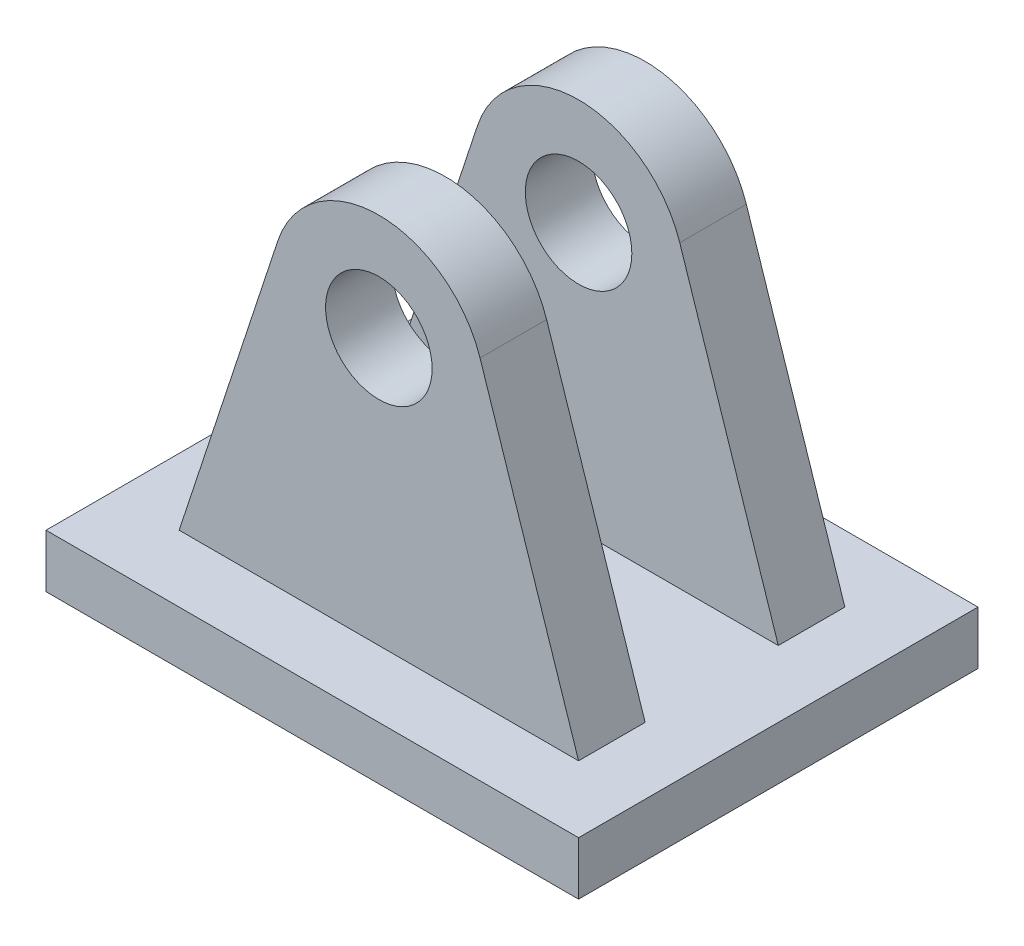
ISO-10303-21;
HEADER;
FILE_DESCRIPTION(('STEP AP214'),'2;1');
FILE_NAME('part.step','',(''),(''),'','','');
FILE_SCHEMA(('AUTOMOTIVE_DESIGN { 1 0 10303 214 1 1 1 1 }'));
ENDSEC;
DATA;
#1=APPLICATION_CONTEXT('core data for automotive mechanical design processes');
#2=APPLICATION_PROTOCOL_DEFINITION('international standard','automotive_design',2000,#1);
#3=PRODUCT_CONTEXT('',#1,'mechanical');
#4=PRODUCT('Part','Part','',(#3));
#5=PRODUCT_RELATED_PRODUCT_CATEGORY('part','',(#4));
#6=PRODUCT_DEFINITION_FORMATION('','',#4);
#7=PRODUCT_DEFINITION_CONTEXT('part definition',#1,'design');
#8=PRODUCT_DEFINITION('design','',#6,#7);
#9=PRODUCT_DEFINITION_SHAPE('','',#8);
#10=(LENGTH_UNIT() NAMED_UNIT(*) SI_UNIT(.MILLI.,.METRE.));
#11=(NAMED_UNIT(*) PLANE_ANGLE_UNIT() SI_UNIT($,.RADIAN.));
#12=(NAMED_UNIT(*) SI_UNIT($,.STERADIAN.) SOLID_ANGLE_UNIT());
#13=UNCERTAINTY_MEASURE_WITH_UNIT(LENGTH_MEASURE(1.E-05),#10,'distance_accuracy_value','');
#14=(GEOMETRIC_REPRESENTATION_CONTEXT(3) GLOBAL_UNCERTAINTY_ASSIGNED_CONTEXT((#13)) GLOBAL_UNIT_ASSIGNED_CONTEXT((#10,
#11,#12)) REPRESENTATION_CONTEXT('',''));
#15=CARTESIAN_POINT('',(0.,0.,0.));
#16=DIRECTION('',(0.,0.,1.));
#17=DIRECTION('',(1.,0.,0.));
#18=AXIS2_PLACEMENT_3D('',#15,#16,#17);
#19=CARTESIAN_POINT('',(0.,120.,50.));
#20=DIRECTION('',(0.,0.,-1.));
#21=DIRECTION('',(-1.,0.,0.));
#22=AXIS2_PLACEMENT_3D('',#19,#20,#21);
#23=CYLINDRICAL_SURFACE('',#22,40.);
#24=CARTESIAN_POINT('',(0.,120.,-25.));
#25=DIRECTION('',(0.,0.,1.));
#26=DIRECTION('',(1.,0.,0.));
#27=AXIS2_PLACEMENT_3D('',#24,#25,#26);
#28=CIRCLE('',#27,40.);
#29=CARTESIAN_POINT('',(37.9973613627572,132.498021022068,-25.));
#30=VERTEX_POINT('',#29);
#31=CARTESIAN_POINT('',(-37.9973613627572,132.498021022068,-25.));
#32=VERTEX_POINT('',#31);
#33=EDGE_CURVE('E131',#30,#32,#28,.T.);
#34=ORIENTED_EDGE('',*,*,#33,.F.);
#35=DIRECTION('',(0.,0.,-1.));
#36=VECTOR('',#35,1.);
#37=CARTESIAN_POINT('',(37.9973613627572,132.498021022068,50.));
#38=LINE('',#37,#36);
#39=CARTESIAN_POINT('',(37.9973613627572,132.498021022068,-50.));
#40=VERTEX_POINT('',#39);
#41=EDGE_CURVE('E241',#30,#40,#38,.T.);
#42=ORIENTED_EDGE('',*,*,#41,.T.);
#43=CARTESIAN_POINT('',(0.,120.,-50.));
#44=DIRECTION('',(0.,0.,1.));
#45=DIRECTION('',(1.,0.,0.));
#46=AXIS2_PLACEMENT_3D('',#43,#44,#45);
#47=CIRCLE('',#46,40.);
#48=CARTESIAN_POINT('',(-37.9973613627572,132.498021022068,-50.));
#49=VERTEX_POINT('',#48);
#50=EDGE_CURVE('E151',#40,#49,#47,.T.);
#51=ORIENTED_EDGE('',*,*,#50,.T.);
#52=DIRECTION('',(0.,0.,-1.));
#53=VECTOR('',#52,1.);
#54=CARTESIAN_POINT('',(-37.9973613627572,132.498021022068,50.));
#55=LINE('',#54,#53);
#56=EDGE_CURVE('E145',#32,#49,#55,.T.);
#57=ORIENTED_EDGE('',*,*,#56,.F.);
#58=EDGE_LOOP('',(#34,#42,#51,#57));
#59=FACE_BOUND('',#58,.T.);
#60=ADVANCED_FACE('F39',(#59),#23,.T.);
#61=CARTESIAN_POINT('',(-37.9973613627572,132.498021022068,50.));
#62=DIRECTION('',(0.949934034068929,-0.312450525551696,0.));
#63=DIRECTION('',(0.312450525551696,0.949934034068929,0.));
#64=AXIS2_PLACEMENT_3D('',#61,#62,#63);
#65=PLANE('',#64);
#66=DIRECTION('',(-0.312450525551696,-0.949934034068929,0.));
#67=VECTOR('',#66,1.);
#68=CARTESIAN_POINT('',(-37.9973613627572,132.498021022068,-25.));
#69=LINE('',#68,#67);
#70=CARTESIAN_POINT('',(-75.,20.,-25.));
#71=VERTEX_POINT('',#70);
#72=EDGE_CURVE('E134',#32,#71,#69,.T.);
#73=ORIENTED_EDGE('',*,*,#72,.F.);
#74=ORIENTED_EDGE('',*,*,#56,.T.);
#75=DIRECTION('',(-0.312450525551696,-0.949934034068929,0.));
#76=VECTOR('',#75,1.);
#77=CARTESIAN_POINT('',(-37.9973613627572,132.498021022068,-50.));
#78=LINE('',#77,#76);
#79=CARTESIAN_POINT('',(-75.,20.,-50.));
#80=VERTEX_POINT('',#79);
#81=EDGE_CURVE('E268',#49,#80,#78,.T.);
#82=ORIENTED_EDGE('',*,*,#81,.T.);
#83=DIRECTION('',(0.,0.,-1.));
#84=VECTOR('',#83,1.);
#85=CARTESIAN_POINT('',(-75.,20.,50.));
#86=LINE('',#85,#84);
#87=EDGE_CURVE('E63',#71,#80,#86,.T.);
#88=ORIENTED_EDGE('',*,*,#87,.F.);
#89=EDGE_LOOP('',(#73,#74,#82,#88));
#90=FACE_BOUND('',#89,.T.);
#91=ADVANCED_FACE('F143',(#90),#65,.F.);
#92=CARTESIAN_POINT('',(37.9973613627572,132.498021022068,50.));
#93=DIRECTION('',(-0.949934034068929,-0.312450525551696,0.));
#94=DIRECTION('',(0.312450525551696,-0.949934034068929,0.));
#95=AXIS2_PLACEMENT_3D('',#92,#93,#94);
#96=PLANE('',#95);
#97=DIRECTION('',(-0.312450525551696,0.949934034068929,0.));
#98=VECTOR('',#97,1.);
#99=CARTESIAN_POINT('',(75.,20.,-25.));
#100=LINE('',#99,#98);
#101=CARTESIAN_POINT('',(75.,20.,-25.));
#102=VERTEX_POINT('',#101);
#103=EDGE_CURVE('E136',#102,#30,#100,.T.);
#104=ORIENTED_EDGE('',*,*,#103,.F.);
#105=DIRECTION('',(0.,0.,-1.));
#106=VECTOR('',#105,1.);
#107=CARTESIAN_POINT('',(75.,20.,50.));
#108=LINE('',#107,#106);
#109=CARTESIAN_POINT('',(75.,20.,-50.));
#110=VERTEX_POINT('',#109);
#111=EDGE_CURVE('E240',#102,#110,#108,.T.);
#112=ORIENTED_EDGE('',*,*,#111,.T.);
#113=DIRECTION('',(-0.312450525551696,0.949934034068929,0.));
#114=VECTOR('',#113,1.);
#115=CARTESIAN_POINT('',(37.9973613627572,132.498021022068,-50.));
#116=LINE('',#115,#114);
#117=EDGE_CURVE('E246',#110,#40,#116,.T.);
#118=ORIENTED_EDGE('',*,*,#117,.T.);
#119=ORIENTED_EDGE('',*,*,#41,.F.);
#120=EDGE_LOOP('',(#104,#112,#118,#119));
#121=FACE_BOUND('',#120,.T.);
#122=ADVANCED_FACE('F212',(#121),#96,.F.);
#123=CARTESIAN_POINT('',(100.,20.,75.));
#124=DIRECTION('',(-1.,0.,0.));
#125=DIRECTION('',(0.,0.,1.));
#126=AXIS2_PLACEMENT_3D('',#123,#124,#125);
#127=PLANE('',#126);
#128=DIRECTION('',(0.,0.,-1.));
#129=VECTOR('',#128,1.);
#130=CARTESIAN_POINT('',(100.,0.,75.));
#131=LINE('',#130,#129);
#132=CARTESIAN_POINT('',(100.,0.,75.));
#133=VERTEX_POINT('',#132);
#134=CARTESIAN_POINT('',(100.,0.,-75.));
#135=VERTEX_POINT('',#134);
#136=EDGE_CURVE('E156',#133,#135,#131,.T.);
#137=ORIENTED_EDGE('',*,*,#136,.T.);
#138=DIRECTION('',(0.,-1.,0.));
#139=VECTOR('',#138,1.);
#140=CARTESIAN_POINT('',(100.,20.,-75.));
#141=LINE('',#140,#139);
#142=CARTESIAN_POINT('',(100.,20.,-75.));
#143=VERTEX_POINT('',#142);
#144=EDGE_CURVE('E11',#143,#135,#141,.T.);
#145=ORIENTED_EDGE('',*,*,#144,.F.);
#146=DIRECTION('',(0.,0.,-1.));
#147=VECTOR('',#146,1.);
#148=CARTESIAN_POINT('',(100.,20.,75.));
#149=LINE('',#148,#147);
#150=CARTESIAN_POINT('',(100.,20.,75.));
#151=VERTEX_POINT('',#150);
#152=EDGE_CURVE('E161',#151,#143,#149,.T.);
#153=ORIENTED_EDGE('',*,*,#152,.F.);
#154=DIRECTION('',(0.,-1.,0.));
#155=VECTOR('',#154,1.);
#156=CARTESIAN_POINT('',(100.,20.,75.));
#157=LINE('',#156,#155);
#158=EDGE_CURVE('E171',#151,#133,#157,.T.);
#159=ORIENTED_EDGE('',*,*,#158,.T.);
#160=EDGE_LOOP('',(#137,#145,#153,#159));
#161=FACE_BOUND('',#160,.T.);
#162=ADVANCED_FACE('F41',(#161),#127,.F.);
#163=CARTESIAN_POINT('',(-100.,20.,-75.));
#164=DIRECTION('',(0.,0.,1.));
#165=DIRECTION('',(1.,0.,0.));
#166=AXIS2_PLACEMENT_3D('',#163,#164,#165);
#167=PLANE('',#166);
#168=DIRECTION('',(-1.,0.,0.));
#169=VECTOR('',#168,1.);
#170=CARTESIAN_POINT('',(-100.,0.,-75.));
#171=LINE('',#170,#169);
#172=CARTESIAN_POINT('',(-100.,0.,-75.));
#173=VERTEX_POINT('',#172);
#174=EDGE_CURVE('E174',#135,#173,#171,.T.);
#175=ORIENTED_EDGE('',*,*,#174,.T.);
#176=DIRECTION('',(0.,-1.,0.));
#177=VECTOR('',#176,1.);
#178=CARTESIAN_POINT('',(-100.,20.,-75.));
#179=LINE('',#178,#177);
#180=CARTESIAN_POINT('',(-100.,20.,-75.));
#181=VERTEX_POINT('',#180);
#182=EDGE_CURVE('E48',#181,#173,#179,.T.);
#183=ORIENTED_EDGE('',*,*,#182,.F.);
#184=DIRECTION('',(-1.,0.,0.));
#185=VECTOR('',#184,1.);
#186=CARTESIAN_POINT('',(-100.,20.,-75.));
#187=LINE('',#186,#185);
#188=EDGE_CURVE('E164',#143,#181,#187,.T.);
#189=ORIENTED_EDGE('',*,*,#188,.F.);
#190=ORIENTED_EDGE('',*,*,#144,.T.);
#191=EDGE_LOOP('',(#175,#183,#189,#190));
#192=FACE_BOUND('',#191,.T.);
#193=ADVANCED_FACE('F205',(#192),#167,.F.);
#194=CARTESIAN_POINT('',(-100.,20.,75.));
#195=DIRECTION('',(1.,0.,0.));
#196=DIRECTION('',(0.,0.,-1.));
#197=AXIS2_PLACEMENT_3D('',#194,#195,#196);
#198=PLANE('',#197);
#199=DIRECTION('',(0.,0.,1.));
#200=VECTOR('',#199,1.);
#201=CARTESIAN_POINT('',(-100.,0.,75.));
#202=LINE('',#201,#200);
#203=CARTESIAN_POINT('',(-100.,0.,75.));
#204=VERTEX_POINT('',#203);
#205=EDGE_CURVE('E176',#173,#204,#202,.T.);
#206=ORIENTED_EDGE('',*,*,#205,.T.);
#207=DIRECTION('',(0.,-1.,0.));
#208=VECTOR('',#207,1.);
#209=CARTESIAN_POINT('',(-100.,20.,75.));
#210=LINE('',#209,#208);
#211=CARTESIAN_POINT('',(-100.,20.,75.));
#212=VERTEX_POINT('',#211);
#213=EDGE_CURVE('E181',#212,#204,#210,.T.);
#214=ORIENTED_EDGE('',*,*,#213,.F.);
#215=DIRECTION('',(0.,0.,1.));
#216=VECTOR('',#215,1.);
#217=CARTESIAN_POINT('',(-100.,20.,75.));
#218=LINE('',#217,#216);
#219=EDGE_CURVE('E167',#181,#212,#218,.T.);
#220=ORIENTED_EDGE('',*,*,#219,.F.);
#221=ORIENTED_EDGE('',*,*,#182,.T.);
#222=EDGE_LOOP('',(#206,#214,#220,#221));
#223=FACE_BOUND('',#222,.T.);
#224=ADVANCED_FACE('F189',(#223),#198,.F.);
#225=CARTESIAN_POINT('',(-100.,20.,75.));
#226=DIRECTION('',(0.,0.,-1.));
#227=DIRECTION('',(-1.,0.,0.));
#228=AXIS2_PLACEMENT_3D('',#225,#226,#227);
#229=PLANE('',#228);
#230=DIRECTION('',(1.,0.,0.));
#231=VECTOR('',#230,1.);
#232=CARTESIAN_POINT('',(-100.,0.,75.));
#233=LINE('',#232,#231);
#234=EDGE_CURVE('E165',#204,#133,#233,.T.);
#235=ORIENTED_EDGE('',*,*,#234,.T.);
#236=ORIENTED_EDGE('',*,*,#158,.F.);
#237=DIRECTION('',(1.,0.,0.));
#238=VECTOR('',#237,1.);
#239=CARTESIAN_POINT('',(-100.,20.,75.));
#240=LINE('',#239,#238);
#241=EDGE_CURVE('E169',#212,#151,#240,.T.);
#242=ORIENTED_EDGE('',*,*,#241,.F.);
#243=ORIENTED_EDGE('',*,*,#213,.T.);
#244=EDGE_LOOP('',(#235,#236,#242,#243));
#245=FACE_BOUND('',#244,.T.);
#246=ADVANCED_FACE('F198',(#245),#229,.F.);
#247=CARTESIAN_POINT('',(0.,20.,0.));
#248=DIRECTION('',(0.,-1.,0.));
#249=DIRECTION('',(0.,0.,-1.));
#250=AXIS2_PLACEMENT_3D('',#247,#248,#249);
#251=PLANE('',#250);
#252=CARTESIAN_POINT('',(-75.,20.,50.));
#253=VERTEX_POINT('',#252);
#254=CARTESIAN_POINT('',(-75.,20.,25.));
#255=VERTEX_POINT('',#254);
#256=EDGE_CURVE('E153',#253,#255,#86,.T.);
#257=ORIENTED_EDGE('',*,*,#256,.T.);
#258=DIRECTION('',(1.,0.,0.));
#259=VECTOR('',#258,1.);
#260=CARTESIAN_POINT('',(-75.,20.,25.));
#261=LINE('',#260,#259);
#262=CARTESIAN_POINT('',(75.,20.,25.));
#263=VERTEX_POINT('',#262);
#264=EDGE_CURVE('E253',#255,#263,#261,.T.);
#265=ORIENTED_EDGE('',*,*,#264,.T.);
#266=CARTESIAN_POINT('',(75.,20.,50.));
#267=VERTEX_POINT('',#266);
#268=EDGE_CURVE('E243',#267,#263,#108,.T.);
#269=ORIENTED_EDGE('',*,*,#268,.F.);
#270=DIRECTION('',(1.,0.,0.));
#271=VECTOR('',#270,1.);
#272=CARTESIAN_POINT('',(-75.,20.,50.));
#273=LINE('',#272,#271);
#274=EDGE_CURVE('E252',#253,#267,#273,.T.);
#275=ORIENTED_EDGE('',*,*,#274,.F.);
#276=EDGE_LOOP('',(#257,#265,#269,#275));
#277=FACE_BOUND('',#276,.T.);
#278=DIRECTION('',(1.,0.,0.));
#279=VECTOR('',#278,1.);
#280=CARTESIAN_POINT('',(-75.,20.,-25.));
#281=LINE('',#280,#279);
#282=EDGE_CURVE('E147',#71,#102,#281,.T.);
#283=ORIENTED_EDGE('',*,*,#282,.F.);
#284=ORIENTED_EDGE('',*,*,#87,.T.);
#285=DIRECTION('',(1.,0.,0.));
#286=VECTOR('',#285,1.);
#287=CARTESIAN_POINT('',(-75.,20.,-50.));
#288=LINE('',#287,#286);
#289=EDGE_CURVE('E269',#80,#110,#288,.T.);
#290=ORIENTED_EDGE('',*,*,#289,.T.);
#291=ORIENTED_EDGE('',*,*,#111,.F.);
#292=EDGE_LOOP('',(#283,#284,#290,#291));
#293=FACE_BOUND('',#292,.T.);
#294=ORIENTED_EDGE('',*,*,#152,.T.);
#295=ORIENTED_EDGE('',*,*,#188,.T.);
#296=ORIENTED_EDGE('',*,*,#219,.T.);
#297=ORIENTED_EDGE('',*,*,#241,.T.);
#298=EDGE_LOOP('',(#294,#295,#296,#297));
#299=FACE_BOUND('',#298,.T.);
#300=ADVANCED_FACE('F204',(#277,#293,#299),#251,.F.);
#301=CARTESIAN_POINT('',(0.,0.,0.));
#302=DIRECTION('',(0.,-1.,0.));
#303=DIRECTION('',(0.,0.,-1.));
#304=AXIS2_PLACEMENT_3D('',#301,#302,#303);
#305=PLANE('',#304);
#306=ORIENTED_EDGE('',*,*,#136,.F.);
#307=ORIENTED_EDGE('',*,*,#234,.F.);
#308=ORIENTED_EDGE('',*,*,#205,.F.);
#309=ORIENTED_EDGE('',*,*,#174,.F.);
#310=EDGE_LOOP('',(#306,#307,#308,#309));
#311=FACE_BOUND('',#310,.T.);
#312=ADVANCED_FACE('F195',(#311),#305,.T.);
#313=CARTESIAN_POINT('',(37.9973613627572,132.498021022068,50.));
#314=VERTEX_POINT('',#313);
#315=CARTESIAN_POINT('',(37.9973613627572,132.498021022068,25.));
#316=VERTEX_POINT('',#315);
#317=EDGE_CURVE('E234',#314,#316,#38,.T.);
#318=ORIENTED_EDGE('',*,*,#317,.T.);
#319=CARTESIAN_POINT('',(0.,120.,25.));
#320=DIRECTION('',(0.,0.,1.));
#321=DIRECTION('',(1.,0.,0.));
#322=AXIS2_PLACEMENT_3D('',#319,#320,#321);
#323=CIRCLE('',#322,40.);
#324=CARTESIAN_POINT('',(-37.9973613627572,132.498021022068,25.));
#325=VERTEX_POINT('',#324);
#326=EDGE_CURVE('E55',#316,#325,#323,.T.);
#327=ORIENTED_EDGE('',*,*,#326,.T.);
#328=CARTESIAN_POINT('',(-37.9973613627572,132.498021022068,50.));
#329=VERTEX_POINT('',#328);
#330=EDGE_CURVE('E152',#329,#325,#55,.T.);
#331=ORIENTED_EDGE('',*,*,#330,.F.);
#332=CARTESIAN_POINT('',(0.,120.,50.));
#333=DIRECTION('',(0.,0.,1.));
#334=DIRECTION('',(1.,0.,0.));
#335=AXIS2_PLACEMENT_3D('',#332,#333,#334);
#336=CIRCLE('',#335,40.);
#337=EDGE_CURVE('E237',#314,#329,#336,.T.);
#338=ORIENTED_EDGE('',*,*,#337,.F.);
#339=EDGE_LOOP('',(#318,#327,#331,#338));
#340=FACE_BOUND('',#339,.T.);
#341=ADVANCED_FACE('F215',(#340),#23,.T.);
#342=ORIENTED_EDGE('',*,*,#330,.T.);
#343=DIRECTION('',(-0.312450525551696,-0.949934034068929,0.));
#344=VECTOR('',#343,1.);
#345=CARTESIAN_POINT('',(-37.9973613627572,132.498021022068,25.));
#346=LINE('',#345,#344);
#347=EDGE_CURVE('E256',#325,#255,#346,.T.);
#348=ORIENTED_EDGE('',*,*,#347,.T.);
#349=ORIENTED_EDGE('',*,*,#256,.F.);
#350=DIRECTION('',(-0.312450525551696,-0.949934034068929,0.));
#351=VECTOR('',#350,1.);
#352=CARTESIAN_POINT('',(-37.9973613627572,132.498021022068,50.));
#353=LINE('',#352,#351);
#354=EDGE_CURVE('E263',#329,#253,#353,.T.);
#355=ORIENTED_EDGE('',*,*,#354,.F.);
#356=EDGE_LOOP('',(#342,#348,#349,#355));
#357=FACE_BOUND('',#356,.T.);
#358=ADVANCED_FACE('F220',(#357),#65,.F.);
#359=ORIENTED_EDGE('',*,*,#268,.T.);
#360=DIRECTION('',(-0.312450525551696,0.949934034068929,0.));
#361=VECTOR('',#360,1.);
#362=CARTESIAN_POINT('',(75.,20.,25.));
#363=LINE('',#362,#361);
#364=EDGE_CURVE('E140',#263,#316,#363,.T.);
#365=ORIENTED_EDGE('',*,*,#364,.T.);
#366=ORIENTED_EDGE('',*,*,#317,.F.);
#367=DIRECTION('',(-0.312450525551696,0.949934034068929,0.));
#368=VECTOR('',#367,1.);
#369=CARTESIAN_POINT('',(37.9973613627572,132.498021022068,50.));
#370=LINE('',#369,#368);
#371=EDGE_CURVE('E244',#267,#314,#370,.T.);
#372=ORIENTED_EDGE('',*,*,#371,.F.);
#373=EDGE_LOOP('',(#359,#365,#366,#372));
#374=FACE_BOUND('',#373,.T.);
#375=ADVANCED_FACE('F228',(#374),#96,.F.);
#376=CARTESIAN_POINT('',(0.,120.,50.));
#377=DIRECTION('',(0.,0.,1.));
#378=DIRECTION('',(1.,0.,0.));
#379=AXIS2_PLACEMENT_3D('',#376,#377,#378);
#380=PLANE('',#379);
#381=CARTESIAN_POINT('',(0.,120.,50.));
#382=DIRECTION('',(0.,0.,1.));
#383=DIRECTION('',(1.,0.,0.));
#384=AXIS2_PLACEMENT_3D('',#381,#382,#383);
#385=CIRCLE('',#384,20.);
#386=CARTESIAN_POINT('',(20.,120.,50.));
#387=VERTEX_POINT('',#386);
#388=EDGE_CURVE('E448',#387,#387,#385,.T.);
#389=ORIENTED_EDGE('',*,*,#388,.F.);
#390=EDGE_LOOP('',(#389));
#391=FACE_BOUND('',#390,.T.);
#392=ORIENTED_EDGE('',*,*,#337,.T.);
#393=ORIENTED_EDGE('',*,*,#354,.T.);
#394=ORIENTED_EDGE('',*,*,#274,.T.);
#395=ORIENTED_EDGE('',*,*,#371,.T.);
#396=EDGE_LOOP('',(#392,#393,#394,#395));
#397=FACE_BOUND('',#396,.T.);
#398=ADVANCED_FACE('F277',(#391,#397),#380,.T.);
#399=CARTESIAN_POINT('',(0.,120.,-50.));
#400=DIRECTION('',(0.,0.,1.));
#401=DIRECTION('',(1.,0.,0.));
#402=AXIS2_PLACEMENT_3D('',#399,#400,#401);
#403=PLANE('',#402);
#404=CARTESIAN_POINT('',(0.,120.,-50.));
#405=DIRECTION('',(0.,0.,1.));
#406=DIRECTION('',(1.,0.,0.));
#407=AXIS2_PLACEMENT_3D('',#404,#405,#406);
#408=CIRCLE('',#407,20.);
#409=CARTESIAN_POINT('',(20.,120.,-50.));
#410=VERTEX_POINT('',#409);
#411=EDGE_CURVE('E440',#410,#410,#408,.T.);
#412=ORIENTED_EDGE('',*,*,#411,.T.);
#413=EDGE_LOOP('',(#412));
#414=FACE_BOUND('',#413,.T.);
#415=ORIENTED_EDGE('',*,*,#50,.F.);
#416=ORIENTED_EDGE('',*,*,#117,.F.);
#417=ORIENTED_EDGE('',*,*,#289,.F.);
#418=ORIENTED_EDGE('',*,*,#81,.F.);
#419=EDGE_LOOP('',(#415,#416,#417,#418));
#420=FACE_BOUND('',#419,.T.);
#421=ADVANCED_FACE('F275',(#414,#420),#403,.F.);
#422=CARTESIAN_POINT('',(0.,120.,-25.));
#423=DIRECTION('',(0.,0.,1.));
#424=DIRECTION('',(1.,0.,0.));
#425=AXIS2_PLACEMENT_3D('',#422,#423,#424);
#426=PLANE('',#425);
#427=CARTESIAN_POINT('',(0.,120.,-25.));
#428=DIRECTION('',(0.,0.,1.));
#429=DIRECTION('',(1.,0.,0.));
#430=AXIS2_PLACEMENT_3D('',#427,#428,#429);
#431=CIRCLE('',#430,20.);
#432=CARTESIAN_POINT('',(20.,120.,-25.));
#433=VERTEX_POINT('',#432);
#434=EDGE_CURVE('E438',#433,#433,#431,.T.);
#435=ORIENTED_EDGE('',*,*,#434,.F.);
#436=EDGE_LOOP('',(#435));
#437=FACE_BOUND('',#436,.T.);
#438=ORIENTED_EDGE('',*,*,#33,.T.);
#439=ORIENTED_EDGE('',*,*,#72,.T.);
#440=ORIENTED_EDGE('',*,*,#282,.T.);
#441=ORIENTED_EDGE('',*,*,#103,.T.);
#442=EDGE_LOOP('',(#438,#439,#440,#441));
#443=FACE_BOUND('',#442,.T.);
#444=ADVANCED_FACE('F133',(#437,#443),#426,.T.);
#445=CARTESIAN_POINT('',(0.,120.,25.));
#446=DIRECTION('',(0.,0.,1.));
#447=DIRECTION('',(1.,0.,0.));
#448=AXIS2_PLACEMENT_3D('',#445,#446,#447);
#449=PLANE('',#448);
#450=CARTESIAN_POINT('',(0.,120.,25.));
#451=DIRECTION('',(0.,0.,1.));
#452=DIRECTION('',(1.,0.,0.));
#453=AXIS2_PLACEMENT_3D('',#450,#451,#452);
#454=CIRCLE('',#453,20.);
#455=CARTESIAN_POINT('',(20.,120.,25.));
#456=VERTEX_POINT('',#455);
#457=EDGE_CURVE('E43',#456,#456,#454,.T.);
#458=ORIENTED_EDGE('',*,*,#457,.T.);
#459=EDGE_LOOP('',(#458));
#460=FACE_BOUND('',#459,.T.);
#461=ORIENTED_EDGE('',*,*,#326,.F.);
#462=ORIENTED_EDGE('',*,*,#364,.F.);
#463=ORIENTED_EDGE('',*,*,#264,.F.);
#464=ORIENTED_EDGE('',*,*,#347,.F.);
#465=EDGE_LOOP('',(#461,#462,#463,#464));
#466=FACE_BOUND('',#465,.T.);
#467=ADVANCED_FACE('F258',(#460,#466),#449,.F.);
#468=CARTESIAN_POINT('',(0.,120.,-75.));
#469=DIRECTION('',(0.,0.,1.));
#470=DIRECTION('',(1.,0.,0.));
#471=AXIS2_PLACEMENT_3D('',#468,#469,#470);
#472=CYLINDRICAL_SURFACE('',#471,20.);
#473=ORIENTED_EDGE('',*,*,#388,.T.);
#474=EDGE_LOOP('',(#473));
#475=FACE_BOUND('',#474,.T.);
#476=ORIENTED_EDGE('',*,*,#457,.F.);
#477=EDGE_LOOP('',(#476));
#478=FACE_BOUND('',#477,.T.);
#479=ADVANCED_FACE('F408',(#475,#478),#472,.F.);
#480=ORIENTED_EDGE('',*,*,#434,.T.);
#481=EDGE_LOOP('',(#480));
#482=FACE_BOUND('',#481,.T.);
#483=ORIENTED_EDGE('',*,*,#411,.F.);
#484=EDGE_LOOP('',(#483));
#485=FACE_BOUND('',#484,.T.);
#486=ADVANCED_FACE('F418',(#482,#485),#472,.F.);
#487=CLOSED_SHELL('',(#60,#91,#122,#162,#193,#224,#246,#300,#312,#341,#358,#375,#398,#421,#444,
#467,#479,#486));
#488=MANIFOLD_SOLID_BREP('B2',#487);
#489=ADVANCED_BREP_SHAPE_REPRESENTATION('',(#18,#488),#14);
#490=SHAPE_DEFINITION_REPRESENTATION(#9,#489);
ENDSEC;
END-ISO-10303-21;
